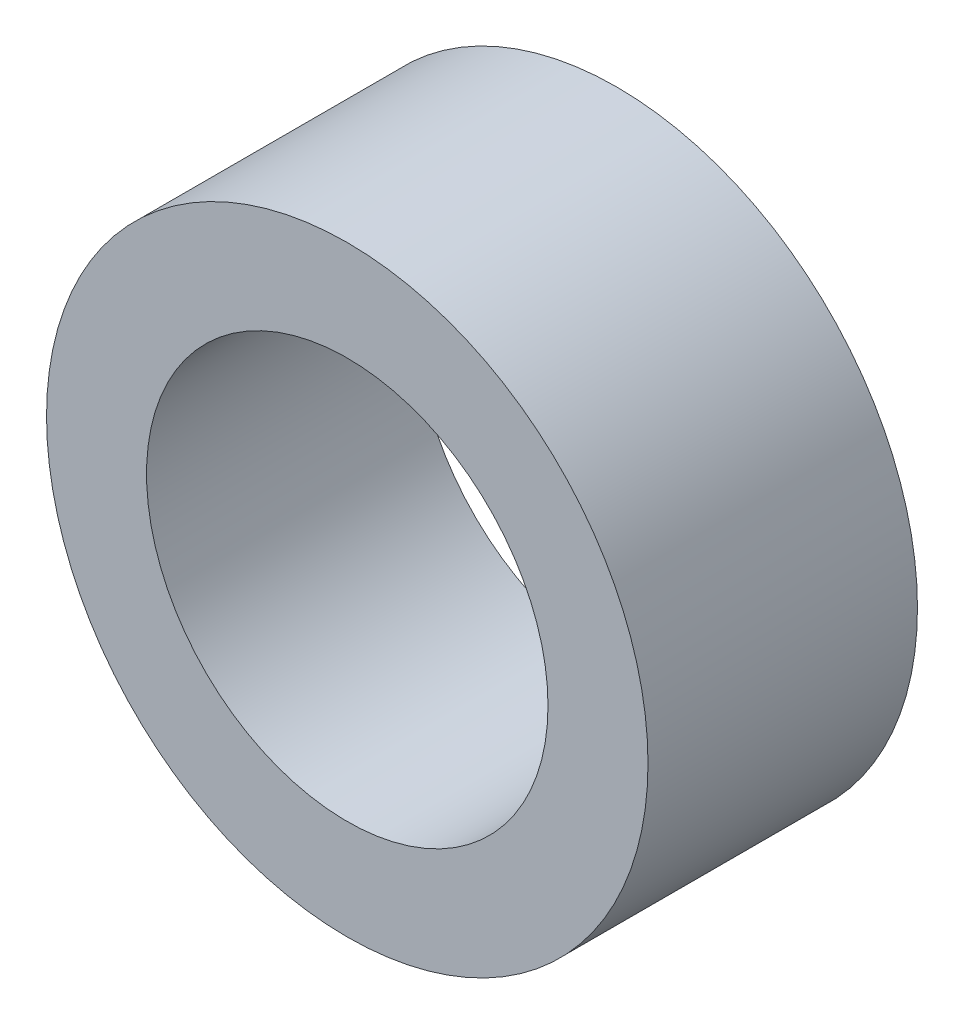
ISO-10303-21;
HEADER;
FILE_DESCRIPTION(('STEP AP214'),'2;1');
FILE_NAME('part.step','',(''),(''),'','','');
FILE_SCHEMA(('AUTOMOTIVE_DESIGN { 1 0 10303 214 1 1 1 1 }'));
ENDSEC;
DATA;
#1=APPLICATION_CONTEXT('core data for automotive mechanical design processes');
#2=APPLICATION_PROTOCOL_DEFINITION('international standard','automotive_design',2000,#1);
#3=PRODUCT_CONTEXT('',#1,'mechanical');
#4=PRODUCT('Part','Part','',(#3));
#5=PRODUCT_RELATED_PRODUCT_CATEGORY('part','',(#4));
#6=PRODUCT_DEFINITION_FORMATION('','',#4);
#7=PRODUCT_DEFINITION_CONTEXT('part definition',#1,'design');
#8=PRODUCT_DEFINITION('design','',#6,#7);
#9=PRODUCT_DEFINITION_SHAPE('','',#8);
#10=(LENGTH_UNIT() NAMED_UNIT(*) SI_UNIT(.MILLI.,.METRE.));
#11=(NAMED_UNIT(*) PLANE_ANGLE_UNIT() SI_UNIT($,.RADIAN.));
#12=(NAMED_UNIT(*) SI_UNIT($,.STERADIAN.) SOLID_ANGLE_UNIT());
#13=UNCERTAINTY_MEASURE_WITH_UNIT(LENGTH_MEASURE(1.E-05),#10,'distance_accuracy_value','');
#14=(GEOMETRIC_REPRESENTATION_CONTEXT(3) GLOBAL_UNCERTAINTY_ASSIGNED_CONTEXT((#13)) GLOBAL_UNIT_ASSIGNED_CONTEXT((#10,
#11,#12)) REPRESENTATION_CONTEXT('',''));
#15=CARTESIAN_POINT('',(0.,0.,0.));
#16=DIRECTION('',(0.,0.,1.));
#17=DIRECTION('',(1.,0.,0.));
#18=AXIS2_PLACEMENT_3D('',#15,#16,#17);
#19=CARTESIAN_POINT('',(0.,0.,-2.1336));
#20=DIRECTION('',(0.,0.,1.));
#21=DIRECTION('',(1.,0.,0.));
#22=AXIS2_PLACEMENT_3D('',#19,#20,#21);
#23=CYLINDRICAL_SURFACE('',#22,4.7625);
#24=CARTESIAN_POINT('',(0.,0.,-2.1336));
#25=DIRECTION('',(0.,0.,1.));
#26=DIRECTION('',(1.,0.,0.));
#27=AXIS2_PLACEMENT_3D('',#24,#25,#26);
#28=CIRCLE('',#27,4.7625);
#29=CARTESIAN_POINT('',(4.7625,0.,-2.1336));
#30=VERTEX_POINT('',#29);
#31=EDGE_CURVE('E10',#30,#30,#28,.T.);
#32=ORIENTED_EDGE('',*,*,#31,.T.);
#33=EDGE_LOOP('',(#32));
#34=FACE_BOUND('',#33,.T.);
#35=CARTESIAN_POINT('',(0.,0.,2.1336));
#36=DIRECTION('',(0.,0.,1.));
#37=DIRECTION('',(1.,0.,0.));
#38=AXIS2_PLACEMENT_3D('',#35,#36,#37);
#39=CIRCLE('',#38,4.7625);
#40=CARTESIAN_POINT('',(4.7625,0.,2.1336));
#41=VERTEX_POINT('',#40);
#42=EDGE_CURVE('E57',#41,#41,#39,.T.);
#43=ORIENTED_EDGE('',*,*,#42,.F.);
#44=EDGE_LOOP('',(#43));
#45=FACE_BOUND('',#44,.T.);
#46=ADVANCED_FACE('F45',(#34,#45),#23,.T.);
#47=CARTESIAN_POINT('',(0.,0.,-2.1336));
#48=DIRECTION('',(0.,0.,1.));
#49=DIRECTION('',(1.,0.,0.));
#50=AXIS2_PLACEMENT_3D('',#47,#48,#49);
#51=PLANE('',#50);
#52=CARTESIAN_POINT('',(0.,0.,-2.1336));
#53=DIRECTION('',(0.,0.,1.));
#54=DIRECTION('',(1.,0.,0.));
#55=AXIS2_PLACEMENT_3D('',#52,#53,#54);
#56=CIRCLE('',#55,3.17881);
#57=CARTESIAN_POINT('',(3.17881,0.,-2.1336));
#58=VERTEX_POINT('',#57);
#59=EDGE_CURVE('E52',#58,#58,#56,.T.);
#60=ORIENTED_EDGE('',*,*,#59,.T.);
#61=EDGE_LOOP('',(#60));
#62=FACE_BOUND('',#61,.T.);
#63=ORIENTED_EDGE('',*,*,#31,.F.);
#64=EDGE_LOOP('',(#63));
#65=FACE_BOUND('',#64,.T.);
#66=ADVANCED_FACE('F77',(#62,#65),#51,.F.);
#67=CARTESIAN_POINT('',(0.,0.,-2.1336));
#68=DIRECTION('',(0.,0.,1.));
#69=DIRECTION('',(1.,0.,0.));
#70=AXIS2_PLACEMENT_3D('',#67,#68,#69);
#71=CYLINDRICAL_SURFACE('',#70,3.17881);
#72=ORIENTED_EDGE('',*,*,#59,.F.);
#73=EDGE_LOOP('',(#72));
#74=FACE_BOUND('',#73,.T.);
#75=CARTESIAN_POINT('',(0.,0.,2.1336));
#76=DIRECTION('',(0.,0.,1.));
#77=DIRECTION('',(1.,0.,0.));
#78=AXIS2_PLACEMENT_3D('',#75,#76,#77);
#79=CIRCLE('',#78,3.17881);
#80=CARTESIAN_POINT('',(3.17881,0.,2.1336));
#81=VERTEX_POINT('',#80);
#82=EDGE_CURVE('E62',#81,#81,#79,.T.);
#83=ORIENTED_EDGE('',*,*,#82,.T.);
#84=EDGE_LOOP('',(#83));
#85=FACE_BOUND('',#84,.T.);
#86=ADVANCED_FACE('F69',(#74,#85),#71,.F.);
#87=CARTESIAN_POINT('',(0.,0.,2.1336));
#88=DIRECTION('',(0.,0.,1.));
#89=DIRECTION('',(1.,0.,0.));
#90=AXIS2_PLACEMENT_3D('',#87,#88,#89);
#91=PLANE('',#90);
#92=ORIENTED_EDGE('',*,*,#42,.T.);
#93=EDGE_LOOP('',(#92));
#94=FACE_BOUND('',#93,.T.);
#95=ORIENTED_EDGE('',*,*,#82,.F.);
#96=EDGE_LOOP('',(#95));
#97=FACE_BOUND('',#96,.T.);
#98=ADVANCED_FACE('F71',(#94,#97),#91,.T.);
#99=CLOSED_SHELL('',(#46,#66,#86,#98));
#100=MANIFOLD_SOLID_BREP('B2',#99);
#101=ADVANCED_BREP_SHAPE_REPRESENTATION('',(#18,#100),#14);
#102=SHAPE_DEFINITION_REPRESENTATION(#9,#101);
ENDSEC;
END-ISO-10303-21;
